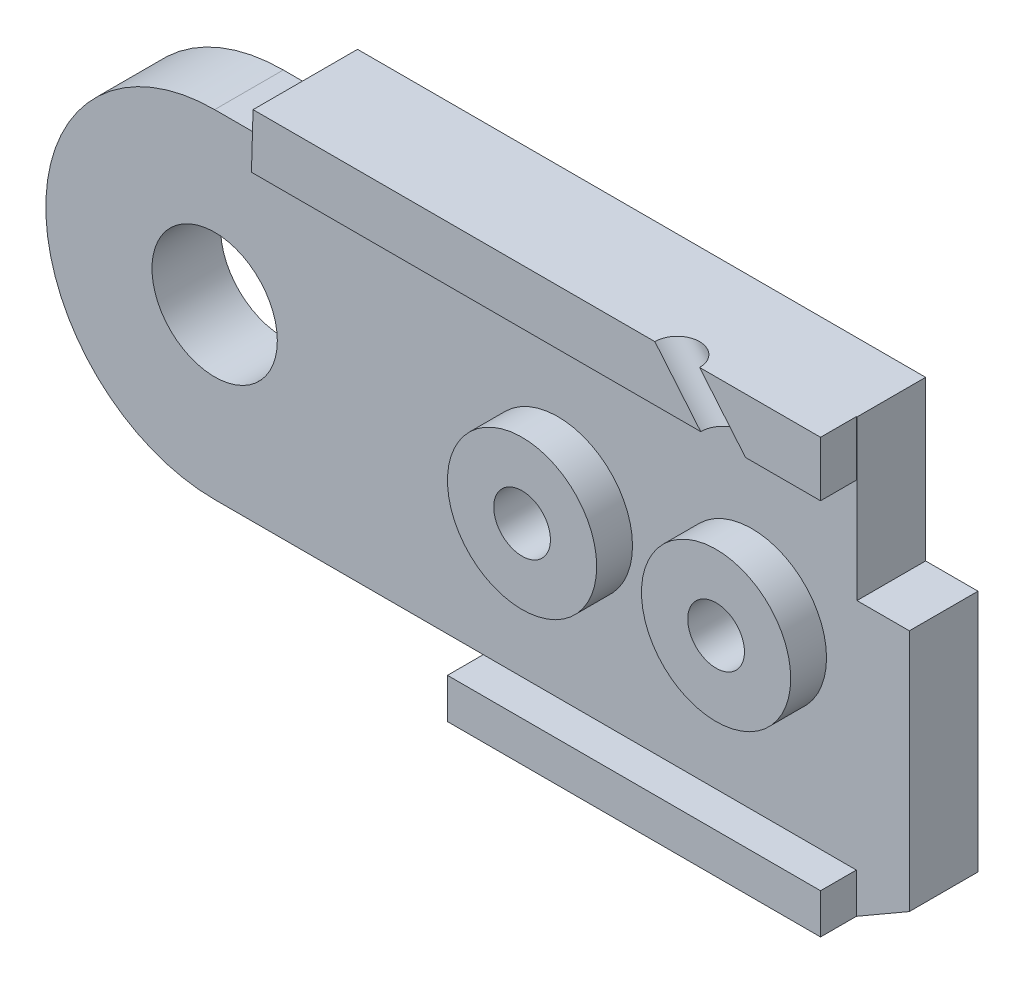
ISO-10303-21;
HEADER;
FILE_DESCRIPTION(('STEP AP214'),'2;1');
FILE_NAME('part.step','',(''),(''),'','','');
FILE_SCHEMA(('AUTOMOTIVE_DESIGN { 1 0 10303 214 1 1 1 1 }'));
ENDSEC;
DATA;
#1=APPLICATION_CONTEXT('core data for automotive mechanical design processes');
#2=APPLICATION_PROTOCOL_DEFINITION('international standard','automotive_design',2000,#1);
#3=PRODUCT_CONTEXT('',#1,'mechanical');
#4=PRODUCT('Part','Part','',(#3));
#5=PRODUCT_RELATED_PRODUCT_CATEGORY('part','',(#4));
#6=PRODUCT_DEFINITION_FORMATION('','',#4);
#7=PRODUCT_DEFINITION_CONTEXT('part definition',#1,'design');
#8=PRODUCT_DEFINITION('design','',#6,#7);
#9=PRODUCT_DEFINITION_SHAPE('','',#8);
#10=(LENGTH_UNIT() NAMED_UNIT(*) SI_UNIT(.MILLI.,.METRE.));
#11=(NAMED_UNIT(*) PLANE_ANGLE_UNIT() SI_UNIT($,.RADIAN.));
#12=(NAMED_UNIT(*) SI_UNIT($,.STERADIAN.) SOLID_ANGLE_UNIT());
#13=UNCERTAINTY_MEASURE_WITH_UNIT(LENGTH_MEASURE(1.E-05),#10,'distance_accuracy_value','');
#14=(GEOMETRIC_REPRESENTATION_CONTEXT(3) GLOBAL_UNCERTAINTY_ASSIGNED_CONTEXT((#13)) GLOBAL_UNIT_ASSIGNED_CONTEXT((#10,
#11,#12)) REPRESENTATION_CONTEXT('',''));
#15=CARTESIAN_POINT('',(0.,0.,0.));
#16=DIRECTION('',(0.,0.,1.));
#17=DIRECTION('',(1.,0.,0.));
#18=AXIS2_PLACEMENT_3D('',#15,#16,#17);
#19=CARTESIAN_POINT('',(0.,0.,4.5));
#20=DIRECTION('',(0.,0.,1.));
#21=DIRECTION('',(1.,0.,0.));
#22=AXIS2_PLACEMENT_3D('',#19,#20,#21);
#23=PLANE('',#22);
#24=CARTESIAN_POINT('',(11.5,0.,4.5));
#25=DIRECTION('',(0.,0.,1.));
#26=DIRECTION('',(1.,0.,0.));
#27=AXIS2_PLACEMENT_3D('',#24,#25,#26);
#28=CIRCLE('',#27,0.949999999999999);
#29=CARTESIAN_POINT('',(12.45,0.,4.5));
#30=VERTEX_POINT('',#29);
#31=EDGE_CURVE('E707',#30,#30,#28,.T.);
#32=ORIENTED_EDGE('',*,*,#31,.T.);
#33=EDGE_LOOP('',(#32));
#34=FACE_BOUND('',#33,.T.);
#35=CARTESIAN_POINT('',(18.,0.,4.5));
#36=DIRECTION('',(0.,0.,1.));
#37=DIRECTION('',(1.,0.,0.));
#38=AXIS2_PLACEMENT_3D('',#35,#36,#37);
#39=CIRCLE('',#38,0.950000000000001);
#40=CARTESIAN_POINT('',(18.95,0.,4.5));
#41=VERTEX_POINT('',#40);
#42=EDGE_CURVE('E700',#41,#41,#39,.T.);
#43=ORIENTED_EDGE('',*,*,#42,.T.);
#44=EDGE_LOOP('',(#43));
#45=FACE_BOUND('',#44,.T.);
#46=CARTESIAN_POINT('',(0.,0.,4.5));
#47=DIRECTION('',(0.,0.,1.));
#48=DIRECTION('',(1.,0.,0.));
#49=AXIS2_PLACEMENT_3D('',#46,#47,#48);
#50=CIRCLE('',#49,2.1);
#51=CARTESIAN_POINT('',(2.1,0.,4.5));
#52=VERTEX_POINT('',#51);
#53=EDGE_CURVE('E217',#52,#52,#50,.T.);
#54=ORIENTED_EDGE('',*,*,#53,.T.);
#55=EDGE_LOOP('',(#54));
#56=FACE_BOUND('',#55,.T.);
#57=DIRECTION('',(0.,-1.,0.));
#58=VECTOR('',#57,1.);
#59=CARTESIAN_POINT('',(21.5203540034992,0.,4.5));
#60=LINE('',#59,#58);
#61=CARTESIAN_POINT('',(21.5203540034992,7.5,4.5));
#62=VERTEX_POINT('',#61);
#63=CARTESIAN_POINT('',(21.5203540034992,2.1720062451962,4.5));
#64=VERTEX_POINT('',#63);
#65=EDGE_CURVE('E309',#62,#64,#60,.T.);
#66=ORIENTED_EDGE('',*,*,#65,.T.);
#67=DIRECTION('',(1.,0.,0.));
#68=VECTOR('',#67,1.);
#69=CARTESIAN_POINT('',(0.,2.1720062451962,4.5));
#70=LINE('',#69,#68);
#71=CARTESIAN_POINT('',(23.2751262658471,2.1720062451962,4.5));
#72=VERTEX_POINT('',#71);
#73=EDGE_CURVE('E313',#64,#72,#70,.T.);
#74=ORIENTED_EDGE('',*,*,#73,.T.);
#75=DIRECTION('',(0.,1.,0.));
#76=VECTOR('',#75,1.);
#77=CARTESIAN_POINT('',(23.2751262658471,-5.97487373415292,4.5));
#78=LINE('',#77,#76);
#79=CARTESIAN_POINT('',(23.2751262658471,-5.97487373415292,4.5));
#80=VERTEX_POINT('',#79);
#81=EDGE_CURVE('E263',#80,#72,#78,.T.);
#82=ORIENTED_EDGE('',*,*,#81,.F.);
#83=DIRECTION('',(0.865971186561437,0.500093895229063,0.));
#84=VECTOR('',#83,1.);
#85=CARTESIAN_POINT('',(21.5,-6.99999999999999,4.5));
#86=LINE('',#85,#84);
#87=CARTESIAN_POINT('',(21.5,-6.99999999999999,4.5));
#88=VERTEX_POINT('',#87);
#89=EDGE_CURVE('E260',#88,#80,#86,.T.);
#90=ORIENTED_EDGE('',*,*,#89,.F.);
#91=DIRECTION('',(1.,0.,0.));
#92=VECTOR('',#91,1.);
#93=CARTESIAN_POINT('',(9.,-6.99999999999999,4.5));
#94=LINE('',#93,#92);
#95=CARTESIAN_POINT('',(9.,-6.99999999999999,4.5));
#96=VERTEX_POINT('',#95);
#97=EDGE_CURVE('E257',#96,#88,#94,.T.);
#98=ORIENTED_EDGE('',*,*,#97,.F.);
#99=DIRECTION('',(0.,-1.,0.));
#100=VECTOR('',#99,1.);
#101=CARTESIAN_POINT('',(9.,-6.99999999999999,4.5));
#102=LINE('',#101,#100);
#103=CARTESIAN_POINT('',(9.,-5.65685424949238,4.5));
#104=VERTEX_POINT('',#103);
#105=EDGE_CURVE('E254',#104,#96,#102,.T.);
#106=ORIENTED_EDGE('',*,*,#105,.F.);
#107=DIRECTION('',(1.,0.,0.));
#108=VECTOR('',#107,1.);
#109=CARTESIAN_POINT('',(9.,-5.65685424949238,4.5));
#110=LINE('',#109,#108);
#111=CARTESIAN_POINT('',(0.,-5.65685424949238,4.5));
#112=VERTEX_POINT('',#111);
#113=EDGE_CURVE('E251',#112,#104,#110,.T.);
#114=ORIENTED_EDGE('',*,*,#113,.F.);
#115=CARTESIAN_POINT('',(0.,0.,4.5));
#116=DIRECTION('',(0.,0.,1.));
#117=DIRECTION('',(1.,0.,0.));
#118=AXIS2_PLACEMENT_3D('',#115,#116,#117);
#119=CIRCLE('',#118,5.65685424949238);
#120=CARTESIAN_POINT('',(0.,5.65685424949238,4.5));
#121=VERTEX_POINT('',#120);
#122=EDGE_CURVE('E221',#121,#112,#119,.T.);
#123=ORIENTED_EDGE('',*,*,#122,.F.);
#124=DIRECTION('',(-1.,0.,0.));
#125=VECTOR('',#124,1.);
#126=CARTESIAN_POINT('',(2.4326880657739,5.65685424949238,4.5));
#127=LINE('',#126,#125);
#128=CARTESIAN_POINT('',(2.4326880657739,5.65685424949238,4.5));
#129=VERTEX_POINT('',#128);
#130=EDGE_CURVE('E230',#129,#121,#127,.T.);
#131=ORIENTED_EDGE('',*,*,#130,.F.);
#132=DIRECTION('',(-0.0293404845923219,-0.999569475306188,0.));
#133=VECTOR('',#132,1.);
#134=CARTESIAN_POINT('',(2.4326880657739,5.65685424949238,4.5));
#135=LINE('',#134,#133);
#136=CARTESIAN_POINT('',(2.48679014755027,7.5,4.5));
#137=VERTEX_POINT('',#136);
#138=EDGE_CURVE('E270',#137,#129,#135,.T.);
#139=ORIENTED_EDGE('',*,*,#138,.F.);
#140=DIRECTION('',(-1.,0.,0.));
#141=VECTOR('',#140,1.);
#142=CARTESIAN_POINT('',(27.,7.5,4.5));
#143=LINE('',#142,#141);
#144=EDGE_CURVE('E267',#62,#137,#143,.T.);
#145=ORIENTED_EDGE('',*,*,#144,.F.);
#146=EDGE_LOOP('',(#66,#74,#82,#90,#98,#106,#114,#123,#131,#139,#145));
#147=FACE_BOUND('',#146,.T.);
#148=ADVANCED_FACE('F42',(#34,#45,#56,#147),#23,.F.);
#149=CARTESIAN_POINT('',(11.5,0.,8.));
#150=DIRECTION('',(0.,0.,-1.));
#151=DIRECTION('',(-1.,0.,0.));
#152=AXIS2_PLACEMENT_3D('',#149,#150,#151);
#153=CYLINDRICAL_SURFACE('',#152,2.5);
#154=CARTESIAN_POINT('',(11.5,0.,8.));
#155=DIRECTION('',(0.,0.,1.));
#156=DIRECTION('',(1.,0.,0.));
#157=AXIS2_PLACEMENT_3D('',#154,#155,#156);
#158=CIRCLE('',#157,2.5);
#159=CARTESIAN_POINT('',(14.,0.,8.));
#160=VERTEX_POINT('',#159);
#161=EDGE_CURVE('E346',#160,#160,#158,.T.);
#162=ORIENTED_EDGE('',*,*,#161,.F.);
#163=EDGE_LOOP('',(#162));
#164=FACE_BOUND('',#163,.T.);
#165=CARTESIAN_POINT('',(11.5,0.,6.8));
#166=DIRECTION('',(0.,0.,1.));
#167=DIRECTION('',(1.,0.,0.));
#168=AXIS2_PLACEMENT_3D('',#165,#166,#167);
#169=CIRCLE('',#168,2.5);
#170=CARTESIAN_POINT('',(14.,0.,6.8));
#171=VERTEX_POINT('',#170);
#172=EDGE_CURVE('E716',#171,#171,#169,.T.);
#173=ORIENTED_EDGE('',*,*,#172,.T.);
#174=EDGE_LOOP('',(#173));
#175=FACE_BOUND('',#174,.T.);
#176=ADVANCED_FACE('F437',(#164,#175),#153,.T.);
#177=CARTESIAN_POINT('',(18.,0.,8.));
#178=DIRECTION('',(0.,0.,-1.));
#179=DIRECTION('',(-1.,0.,0.));
#180=AXIS2_PLACEMENT_3D('',#177,#178,#179);
#181=CYLINDRICAL_SURFACE('',#180,2.5);
#182=CARTESIAN_POINT('',(18.,0.,8.));
#183=DIRECTION('',(0.,0.,1.));
#184=DIRECTION('',(1.,0.,0.));
#185=AXIS2_PLACEMENT_3D('',#182,#183,#184);
#186=CIRCLE('',#185,2.5);
#187=CARTESIAN_POINT('',(20.5,0.,8.));
#188=VERTEX_POINT('',#187);
#189=EDGE_CURVE('E712',#188,#188,#186,.T.);
#190=ORIENTED_EDGE('',*,*,#189,.F.);
#191=EDGE_LOOP('',(#190));
#192=FACE_BOUND('',#191,.T.);
#193=CARTESIAN_POINT('',(18.,0.,6.8));
#194=DIRECTION('',(0.,0.,1.));
#195=DIRECTION('',(1.,0.,0.));
#196=AXIS2_PLACEMENT_3D('',#193,#194,#195);
#197=CIRCLE('',#196,2.5);
#198=CARTESIAN_POINT('',(20.5,0.,6.8));
#199=VERTEX_POINT('',#198);
#200=EDGE_CURVE('E711',#199,#199,#197,.T.);
#201=ORIENTED_EDGE('',*,*,#200,.T.);
#202=EDGE_LOOP('',(#201));
#203=FACE_BOUND('',#202,.T.);
#204=ADVANCED_FACE('F439',(#192,#203),#181,.T.);
#205=CARTESIAN_POINT('',(27.,2.1720062451962,4.4));
#206=DIRECTION('',(0.,-1.,0.));
#207=DIRECTION('',(0.,0.,-1.));
#208=AXIS2_PLACEMENT_3D('',#205,#206,#207);
#209=PLANE('',#208);
#210=ORIENTED_EDGE('',*,*,#73,.F.);
#211=DIRECTION('',(0.,0.,1.));
#212=VECTOR('',#211,1.);
#213=CARTESIAN_POINT('',(21.5203540034992,2.1720062451962,4.4));
#214=LINE('',#213,#212);
#215=CARTESIAN_POINT('',(21.5203540034992,2.1720062451962,6.8));
#216=VERTEX_POINT('',#215);
#217=EDGE_CURVE('E65',#64,#216,#214,.T.);
#218=ORIENTED_EDGE('',*,*,#217,.T.);
#219=DIRECTION('',(1.,0.,0.));
#220=VECTOR('',#219,1.);
#221=CARTESIAN_POINT('',(27.,2.1720062451962,6.8));
#222=LINE('',#221,#220);
#223=CARTESIAN_POINT('',(23.2751262658471,2.1720062451962,6.8));
#224=VERTEX_POINT('',#223);
#225=EDGE_CURVE('E340',#216,#224,#222,.T.);
#226=ORIENTED_EDGE('',*,*,#225,.T.);
#227=DIRECTION('',(0.,0.,-1.));
#228=VECTOR('',#227,1.);
#229=CARTESIAN_POINT('',(23.2751262658471,2.1720062451962,6.8));
#230=LINE('',#229,#228);
#231=EDGE_CURVE('E286',#224,#72,#230,.T.);
#232=ORIENTED_EDGE('',*,*,#231,.T.);
#233=EDGE_LOOP('',(#210,#218,#226,#232));
#234=FACE_BOUND('',#233,.T.);
#235=ADVANCED_FACE('F420',(#234),#209,.F.);
#236=CARTESIAN_POINT('',(23.2751262658471,-5.97487373415292,6.8));
#237=DIRECTION('',(-1.,0.,0.));
#238=DIRECTION('',(0.,0.,1.));
#239=AXIS2_PLACEMENT_3D('',#236,#237,#238);
#240=PLANE('',#239);
#241=ORIENTED_EDGE('',*,*,#81,.T.);
#242=ORIENTED_EDGE('',*,*,#231,.F.);
#243=DIRECTION('',(0.,1.,0.));
#244=VECTOR('',#243,1.);
#245=CARTESIAN_POINT('',(23.2751262658471,-5.97487373415292,6.8));
#246=LINE('',#245,#244);
#247=CARTESIAN_POINT('',(23.2751262658471,-5.97487373415292,6.8));
#248=VERTEX_POINT('',#247);
#249=EDGE_CURVE('E237',#248,#224,#246,.T.);
#250=ORIENTED_EDGE('',*,*,#249,.F.);
#251=DIRECTION('',(0.,0.,-1.));
#252=VECTOR('',#251,1.);
#253=CARTESIAN_POINT('',(23.2751262658471,-5.97487373415292,6.8));
#254=LINE('',#253,#252);
#255=EDGE_CURVE('E289',#248,#80,#254,.T.);
#256=ORIENTED_EDGE('',*,*,#255,.T.);
#257=EDGE_LOOP('',(#241,#242,#250,#256));
#258=FACE_BOUND('',#257,.T.);
#259=ADVANCED_FACE('F418',(#258),#240,.F.);
#260=CARTESIAN_POINT('',(21.5,-6.99999999999999,8.));
#261=DIRECTION('',(-1.,0.,0.));
#262=DIRECTION('',(0.,0.,1.));
#263=AXIS2_PLACEMENT_3D('',#260,#261,#262);
#264=PLANE('',#263);
#265=DIRECTION('',(0.,1.,0.));
#266=VECTOR('',#265,1.);
#267=CARTESIAN_POINT('',(21.5,-6.99999999999999,6.8));
#268=LINE('',#267,#266);
#269=CARTESIAN_POINT('',(21.5,-6.99999999999999,6.8));
#270=VERTEX_POINT('',#269);
#271=CARTESIAN_POINT('',(21.5,-5.65685424949238,6.8));
#272=VERTEX_POINT('',#271);
#273=EDGE_CURVE('E358',#270,#272,#268,.T.);
#274=ORIENTED_EDGE('',*,*,#273,.T.);
#275=DIRECTION('',(0.,0.,-1.));
#276=VECTOR('',#275,1.);
#277=CARTESIAN_POINT('',(21.5,-5.65685424949238,8.));
#278=LINE('',#277,#276);
#279=CARTESIAN_POINT('',(21.5,-5.65685424949238,8.));
#280=VERTEX_POINT('',#279);
#281=EDGE_CURVE('E368',#280,#272,#278,.T.);
#282=ORIENTED_EDGE('',*,*,#281,.F.);
#283=DIRECTION('',(0.,1.,0.));
#284=VECTOR('',#283,1.);
#285=CARTESIAN_POINT('',(21.5,-6.99999999999999,8.));
#286=LINE('',#285,#284);
#287=CARTESIAN_POINT('',(21.5,-6.99999999999999,8.));
#288=VERTEX_POINT('',#287);
#289=EDGE_CURVE('E365',#288,#280,#286,.T.);
#290=ORIENTED_EDGE('',*,*,#289,.F.);
#291=DIRECTION('',(0.,0.,-1.));
#292=VECTOR('',#291,1.);
#293=CARTESIAN_POINT('',(21.5,-6.99999999999999,8.));
#294=LINE('',#293,#292);
#295=EDGE_CURVE('E377',#288,#270,#294,.T.);
#296=ORIENTED_EDGE('',*,*,#295,.T.);
#297=EDGE_LOOP('',(#274,#282,#290,#296));
#298=FACE_BOUND('',#297,.T.);
#299=ADVANCED_FACE('F409',(#298),#264,.F.);
#300=CARTESIAN_POINT('',(21.5,-6.99999999999999,6.8));
#301=DIRECTION('',(-0.500093895229063,0.865971186561437,0.));
#302=DIRECTION('',(-0.865971186561437,-0.500093895229063,0.));
#303=AXIS2_PLACEMENT_3D('',#300,#301,#302);
#304=PLANE('',#303);
#305=ORIENTED_EDGE('',*,*,#89,.T.);
#306=ORIENTED_EDGE('',*,*,#255,.F.);
#307=DIRECTION('',(0.865971186561437,0.500093895229063,0.));
#308=VECTOR('',#307,1.);
#309=CARTESIAN_POINT('',(21.5,-6.99999999999999,6.8));
#310=LINE('',#309,#308);
#311=EDGE_CURVE('E234',#270,#248,#310,.T.);
#312=ORIENTED_EDGE('',*,*,#311,.F.);
#313=DIRECTION('',(0.,0.,-1.));
#314=VECTOR('',#313,1.);
#315=CARTESIAN_POINT('',(21.5,-6.99999999999999,6.8));
#316=LINE('',#315,#314);
#317=EDGE_CURVE('E293',#270,#88,#316,.T.);
#318=ORIENTED_EDGE('',*,*,#317,.T.);
#319=EDGE_LOOP('',(#305,#306,#312,#318));
#320=FACE_BOUND('',#319,.T.);
#321=ADVANCED_FACE('F413',(#320),#304,.F.);
#322=CARTESIAN_POINT('',(21.5,-5.65685424949238,8.));
#323=DIRECTION('',(0.,-1.,0.));
#324=DIRECTION('',(0.,0.,-1.));
#325=AXIS2_PLACEMENT_3D('',#322,#323,#324);
#326=PLANE('',#325);
#327=DIRECTION('',(-1.,0.,0.));
#328=VECTOR('',#327,1.);
#329=CARTESIAN_POINT('',(21.5,-5.65685424949238,6.8));
#330=LINE('',#329,#328);
#331=CARTESIAN_POINT('',(9.,-5.65685424949238,6.8));
#332=VERTEX_POINT('',#331);
#333=EDGE_CURVE('E351',#272,#332,#330,.T.);
#334=ORIENTED_EDGE('',*,*,#333,.T.);
#335=DIRECTION('',(0.,0.,-1.));
#336=VECTOR('',#335,1.);
#337=CARTESIAN_POINT('',(9.,-5.65685424949238,8.));
#338=LINE('',#337,#336);
#339=CARTESIAN_POINT('',(9.,-5.65685424949238,8.));
#340=VERTEX_POINT('',#339);
#341=EDGE_CURVE('E202',#340,#332,#338,.T.);
#342=ORIENTED_EDGE('',*,*,#341,.F.);
#343=DIRECTION('',(-1.,0.,0.));
#344=VECTOR('',#343,1.);
#345=CARTESIAN_POINT('',(21.5,-5.65685424949238,8.));
#346=LINE('',#345,#344);
#347=EDGE_CURVE('E353',#280,#340,#346,.T.);
#348=ORIENTED_EDGE('',*,*,#347,.F.);
#349=ORIENTED_EDGE('',*,*,#281,.T.);
#350=EDGE_LOOP('',(#334,#342,#348,#349));
#351=FACE_BOUND('',#350,.T.);
#352=ADVANCED_FACE('F388',(#351),#326,.F.);
#353=CARTESIAN_POINT('',(0.,0.,8.));
#354=DIRECTION('',(0.,0.,1.));
#355=DIRECTION('',(1.,0.,0.));
#356=AXIS2_PLACEMENT_3D('',#353,#354,#355);
#357=PLANE('',#356);
#358=ORIENTED_EDGE('',*,*,#347,.T.);
#359=DIRECTION('',(0.,-1.,0.));
#360=VECTOR('',#359,1.);
#361=CARTESIAN_POINT('',(9.,-5.65685424949238,8.));
#362=LINE('',#361,#360);
#363=CARTESIAN_POINT('',(9.,-6.99999999999999,8.));
#364=VERTEX_POINT('',#363);
#365=EDGE_CURVE('E357',#340,#364,#362,.T.);
#366=ORIENTED_EDGE('',*,*,#365,.T.);
#367=DIRECTION('',(1.,0.,0.));
#368=VECTOR('',#367,1.);
#369=CARTESIAN_POINT('',(9.,-6.99999999999999,8.));
#370=LINE('',#369,#368);
#371=EDGE_CURVE('E362',#364,#288,#370,.T.);
#372=ORIENTED_EDGE('',*,*,#371,.T.);
#373=ORIENTED_EDGE('',*,*,#289,.T.);
#374=EDGE_LOOP('',(#358,#366,#372,#373));
#375=FACE_BOUND('',#374,.T.);
#376=ADVANCED_FACE('F407',(#375),#357,.T.);
#377=CARTESIAN_POINT('',(9.,-6.99999999999999,6.8));
#378=DIRECTION('',(0.,1.,0.));
#379=DIRECTION('',(-1.,0.,0.));
#380=AXIS2_PLACEMENT_3D('',#377,#378,#379);
#381=PLANE('',#380);
#382=ORIENTED_EDGE('',*,*,#97,.T.);
#383=ORIENTED_EDGE('',*,*,#317,.F.);
#384=ORIENTED_EDGE('',*,*,#295,.F.);
#385=ORIENTED_EDGE('',*,*,#371,.F.);
#386=DIRECTION('',(0.,0.,-1.));
#387=VECTOR('',#386,1.);
#388=CARTESIAN_POINT('',(9.,-6.99999999999999,6.8));
#389=LINE('',#388,#387);
#390=EDGE_CURVE('E297',#364,#96,#389,.T.);
#391=ORIENTED_EDGE('',*,*,#390,.T.);
#392=EDGE_LOOP('',(#382,#383,#384,#385,#391));
#393=FACE_BOUND('',#392,.T.);
#394=ADVANCED_FACE('F402',(#393),#381,.F.);
#395=CARTESIAN_POINT('',(9.,-6.99999999999999,6.8));
#396=DIRECTION('',(1.,0.,0.));
#397=DIRECTION('',(0.,0.,-1.));
#398=AXIS2_PLACEMENT_3D('',#395,#396,#397);
#399=PLANE('',#398);
#400=ORIENTED_EDGE('',*,*,#105,.T.);
#401=ORIENTED_EDGE('',*,*,#390,.F.);
#402=ORIENTED_EDGE('',*,*,#365,.F.);
#403=ORIENTED_EDGE('',*,*,#341,.T.);
#404=DIRECTION('',(0.,0.,-1.));
#405=VECTOR('',#404,1.);
#406=CARTESIAN_POINT('',(9.,-5.65685424949238,6.8));
#407=LINE('',#406,#405);
#408=EDGE_CURVE('E301',#332,#104,#407,.T.);
#409=ORIENTED_EDGE('',*,*,#408,.T.);
#410=EDGE_LOOP('',(#400,#401,#402,#403,#409));
#411=FACE_BOUND('',#410,.T.);
#412=ADVANCED_FACE('F382',(#411),#399,.F.);
#413=CARTESIAN_POINT('',(9.,-5.65685424949238,6.8));
#414=DIRECTION('',(0.,1.,0.));
#415=DIRECTION('',(0.,0.,1.));
#416=AXIS2_PLACEMENT_3D('',#413,#414,#415);
#417=PLANE('',#416);
#418=ORIENTED_EDGE('',*,*,#113,.T.);
#419=ORIENTED_EDGE('',*,*,#408,.F.);
#420=DIRECTION('',(1.,0.,0.));
#421=VECTOR('',#420,1.);
#422=CARTESIAN_POINT('',(9.,-5.65685424949238,6.8));
#423=LINE('',#422,#421);
#424=CARTESIAN_POINT('',(0.,-5.65685424949238,6.8));
#425=VERTEX_POINT('',#424);
#426=EDGE_CURVE('E229',#425,#332,#423,.T.);
#427=ORIENTED_EDGE('',*,*,#426,.F.);
#428=DIRECTION('',(0.,0.,-1.));
#429=VECTOR('',#428,1.);
#430=CARTESIAN_POINT('',(0.,-5.65685424949238,6.8));
#431=LINE('',#430,#429);
#432=EDGE_CURVE('E305',#425,#112,#431,.T.);
#433=ORIENTED_EDGE('',*,*,#432,.T.);
#434=EDGE_LOOP('',(#418,#419,#427,#433));
#435=FACE_BOUND('',#434,.T.);
#436=ADVANCED_FACE('F394',(#435),#417,.F.);
#437=CARTESIAN_POINT('',(0.,0.,6.8));
#438=DIRECTION('',(0.,0.,-1.));
#439=DIRECTION('',(-1.,0.,0.));
#440=AXIS2_PLACEMENT_3D('',#437,#438,#439);
#441=CYLINDRICAL_SURFACE('',#440,5.65685424949238);
#442=ORIENTED_EDGE('',*,*,#122,.T.);
#443=ORIENTED_EDGE('',*,*,#432,.F.);
#444=CARTESIAN_POINT('',(0.,0.,6.8));
#445=DIRECTION('',(0.,0.,1.));
#446=DIRECTION('',(1.,0.,0.));
#447=AXIS2_PLACEMENT_3D('',#444,#445,#446);
#448=CIRCLE('',#447,5.65685424949238);
#449=CARTESIAN_POINT('',(0.,5.65685424949238,6.8));
#450=VERTEX_POINT('',#449);
#451=EDGE_CURVE('E225',#450,#425,#448,.T.);
#452=ORIENTED_EDGE('',*,*,#451,.F.);
#453=DIRECTION('',(0.,0.,-1.));
#454=VECTOR('',#453,1.);
#455=CARTESIAN_POINT('',(0.,5.65685424949238,6.8));
#456=LINE('',#455,#454);
#457=EDGE_CURVE('E247',#450,#121,#456,.T.);
#458=ORIENTED_EDGE('',*,*,#457,.T.);
#459=EDGE_LOOP('',(#442,#443,#452,#458));
#460=FACE_BOUND('',#459,.T.);
#461=ADVANCED_FACE('F44',(#460),#441,.T.);
#462=CARTESIAN_POINT('',(2.4326880657739,5.65685424949238,8.));
#463=DIRECTION('',(0.,1.,0.));
#464=DIRECTION('',(0.,0.,1.));
#465=AXIS2_PLACEMENT_3D('',#462,#463,#464);
#466=PLANE('',#465);
#467=DIRECTION('',(1.,0.,0.));
#468=VECTOR('',#467,1.);
#469=CARTESIAN_POINT('',(2.4326880657739,5.65685424949238,8.));
#470=LINE('',#469,#468);
#471=CARTESIAN_POINT('',(18.9854768194204,5.65685424949238,8.));
#472=VERTEX_POINT('',#471);
#473=CARTESIAN_POINT('',(21.5,5.65685424949238,8.));
#474=VERTEX_POINT('',#473);
#475=EDGE_CURVE('E175',#472,#474,#470,.T.);
#476=ORIENTED_EDGE('',*,*,#475,.F.);
#477=CARTESIAN_POINT('',(18.2354768194204,5.65685424949238,8.));
#478=DIRECTION('',(0.,-1.,0.));
#479=DIRECTION('',(0.,0.,-1.));
#480=AXIS2_PLACEMENT_3D('',#477,#478,#479);
#481=CIRCLE('',#480,0.750000000000002);
#482=CARTESIAN_POINT('',(17.4854768194204,5.65685424949238,8.));
#483=VERTEX_POINT('',#482);
#484=EDGE_CURVE('E57',#483,#472,#481,.T.);
#485=ORIENTED_EDGE('',*,*,#484,.F.);
#486=CARTESIAN_POINT('',(2.4326880657739,5.65685424949238,8.));
#487=VERTEX_POINT('',#486);
#488=EDGE_CURVE('E172',#487,#483,#470,.T.);
#489=ORIENTED_EDGE('',*,*,#488,.F.);
#490=DIRECTION('',(0.,0.,-1.));
#491=VECTOR('',#490,1.);
#492=CARTESIAN_POINT('',(2.4326880657739,5.65685424949238,8.));
#493=LINE('',#492,#491);
#494=CARTESIAN_POINT('',(2.4326880657739,5.65685424949238,6.8));
#495=VERTEX_POINT('',#494);
#496=EDGE_CURVE('E213',#487,#495,#493,.T.);
#497=ORIENTED_EDGE('',*,*,#496,.T.);
#498=DIRECTION('',(1.,0.,0.));
#499=VECTOR('',#498,1.);
#500=CARTESIAN_POINT('',(2.4326880657739,5.65685424949238,6.8));
#501=LINE('',#500,#499);
#502=CARTESIAN_POINT('',(21.5,5.65685424949238,6.8));
#503=VERTEX_POINT('',#502);
#504=EDGE_CURVE('E197',#495,#503,#501,.T.);
#505=ORIENTED_EDGE('',*,*,#504,.T.);
#506=DIRECTION('',(0.,0.,-1.));
#507=VECTOR('',#506,1.);
#508=CARTESIAN_POINT('',(21.5,5.65685424949238,8.));
#509=LINE('',#508,#507);
#510=EDGE_CURVE('E209',#474,#503,#509,.T.);
#511=ORIENTED_EDGE('',*,*,#510,.F.);
#512=EDGE_LOOP('',(#476,#485,#489,#497,#505,#511));
#513=FACE_BOUND('',#512,.T.);
#514=ADVANCED_FACE('F170',(#513),#466,.F.);
#515=CARTESIAN_POINT('',(2.4326880657739,5.65685424949238,6.8));
#516=DIRECTION('',(0.,-1.,0.));
#517=DIRECTION('',(0.,0.,-1.));
#518=AXIS2_PLACEMENT_3D('',#515,#516,#517);
#519=PLANE('',#518);
#520=ORIENTED_EDGE('',*,*,#130,.T.);
#521=ORIENTED_EDGE('',*,*,#457,.F.);
#522=DIRECTION('',(-1.,0.,0.));
#523=VECTOR('',#522,1.);
#524=CARTESIAN_POINT('',(2.4326880657739,5.65685424949238,6.8));
#525=LINE('',#524,#523);
#526=EDGE_CURVE('E244',#495,#450,#525,.T.);
#527=ORIENTED_EDGE('',*,*,#526,.F.);
#528=DIRECTION('',(0.,0.,-1.));
#529=VECTOR('',#528,1.);
#530=CARTESIAN_POINT('',(2.4326880657739,5.65685424949238,6.8));
#531=LINE('',#530,#529);
#532=EDGE_CURVE('E278',#495,#129,#531,.T.);
#533=ORIENTED_EDGE('',*,*,#532,.T.);
#534=EDGE_LOOP('',(#520,#521,#527,#533));
#535=FACE_BOUND('',#534,.T.);
#536=ADVANCED_FACE('F432',(#535),#519,.F.);
#537=CARTESIAN_POINT('',(2.4326880657739,5.65685424949238,6.8));
#538=DIRECTION('',(0.999569475306188,-0.0293404845923219,0.));
#539=DIRECTION('',(0.0293404845923219,0.999569475306188,0.));
#540=AXIS2_PLACEMENT_3D('',#537,#538,#539);
#541=PLANE('',#540);
#542=ORIENTED_EDGE('',*,*,#138,.T.);
#543=ORIENTED_EDGE('',*,*,#532,.F.);
#544=ORIENTED_EDGE('',*,*,#496,.F.);
#545=DIRECTION('',(-0.0293404845923219,-0.999569475306188,0.));
#546=VECTOR('',#545,1.);
#547=CARTESIAN_POINT('',(2.48679014755027,7.5,8.));
#548=LINE('',#547,#546);
#549=CARTESIAN_POINT('',(2.48679014755027,7.5,8.));
#550=VERTEX_POINT('',#549);
#551=EDGE_CURVE('E180',#550,#487,#548,.T.);
#552=ORIENTED_EDGE('',*,*,#551,.F.);
#553=DIRECTION('',(0.,0.,-1.));
#554=VECTOR('',#553,1.);
#555=CARTESIAN_POINT('',(2.48679014755027,7.5,6.8));
#556=LINE('',#555,#554);
#557=EDGE_CURVE('E282',#550,#137,#556,.T.);
#558=ORIENTED_EDGE('',*,*,#557,.T.);
#559=EDGE_LOOP('',(#542,#543,#544,#552,#558));
#560=FACE_BOUND('',#559,.T.);
#561=ADVANCED_FACE('F424',(#560),#541,.F.);
#562=CARTESIAN_POINT('',(21.5203540034992,2.1720062451962,4.4));
#563=DIRECTION('',(-1.,0.,0.));
#564=DIRECTION('',(0.,0.,1.));
#565=AXIS2_PLACEMENT_3D('',#562,#563,#564);
#566=PLANE('',#565);
#567=DIRECTION('',(0.,0.,1.));
#568=VECTOR('',#567,1.);
#569=CARTESIAN_POINT('',(21.5203540034992,7.5,4.4));
#570=LINE('',#569,#568);
#571=CARTESIAN_POINT('',(21.5203540034992,7.5,6.8));
#572=VERTEX_POINT('',#571);
#573=EDGE_CURVE('E332',#62,#572,#570,.T.);
#574=ORIENTED_EDGE('',*,*,#573,.T.);
#575=DIRECTION('',(0.,-1.,0.));
#576=VECTOR('',#575,1.);
#577=CARTESIAN_POINT('',(21.5203540034992,2.1720062451962,6.8));
#578=LINE('',#577,#576);
#579=EDGE_CURVE('E339',#572,#216,#578,.T.);
#580=ORIENTED_EDGE('',*,*,#579,.T.);
#581=ORIENTED_EDGE('',*,*,#217,.F.);
#582=ORIENTED_EDGE('',*,*,#65,.F.);
#583=EDGE_LOOP('',(#574,#580,#581,#582));
#584=FACE_BOUND('',#583,.T.);
#585=ADVANCED_FACE('F422',(#584),#566,.F.);
#586=CARTESIAN_POINT('',(0.,0.,6.8));
#587=DIRECTION('',(0.,0.,1.));
#588=DIRECTION('',(1.,0.,0.));
#589=AXIS2_PLACEMENT_3D('',#586,#587,#588);
#590=PLANE('',#589);
#591=ORIENTED_EDGE('',*,*,#200,.F.);
#592=EDGE_LOOP('',(#591));
#593=FACE_BOUND('',#592,.T.);
#594=ORIENTED_EDGE('',*,*,#172,.F.);
#595=EDGE_LOOP('',(#594));
#596=FACE_BOUND('',#595,.T.);
#597=ORIENTED_EDGE('',*,*,#225,.F.);
#598=ORIENTED_EDGE('',*,*,#579,.F.);
#599=DIRECTION('',(-1.,0.,0.));
#600=VECTOR('',#599,1.);
#601=CARTESIAN_POINT('',(27.,7.5,6.8));
#602=LINE('',#601,#600);
#603=CARTESIAN_POINT('',(21.5,7.5,6.8));
#604=VERTEX_POINT('',#603);
#605=EDGE_CURVE('E241',#572,#604,#602,.T.);
#606=ORIENTED_EDGE('',*,*,#605,.T.);
#607=DIRECTION('',(0.,1.,0.));
#608=VECTOR('',#607,1.);
#609=CARTESIAN_POINT('',(21.5,5.65685424949238,6.8));
#610=LINE('',#609,#608);
#611=EDGE_CURVE('E201',#503,#604,#610,.T.);
#612=ORIENTED_EDGE('',*,*,#611,.F.);
#613=ORIENTED_EDGE('',*,*,#504,.F.);
#614=ORIENTED_EDGE('',*,*,#526,.T.);
#615=ORIENTED_EDGE('',*,*,#451,.T.);
#616=ORIENTED_EDGE('',*,*,#426,.T.);
#617=ORIENTED_EDGE('',*,*,#333,.F.);
#618=ORIENTED_EDGE('',*,*,#273,.F.);
#619=ORIENTED_EDGE('',*,*,#311,.T.);
#620=ORIENTED_EDGE('',*,*,#249,.T.);
#621=EDGE_LOOP('',(#597,#598,#606,#612,#613,#614,#615,#616,#617,#618,#619,#620));
#622=FACE_BOUND('',#621,.T.);
#623=CARTESIAN_POINT('',(0.,0.,6.8));
#624=DIRECTION('',(0.,0.,1.));
#625=DIRECTION('',(1.,0.,0.));
#626=AXIS2_PLACEMENT_3D('',#623,#624,#625);
#627=CIRCLE('',#626,2.1);
#628=CARTESIAN_POINT('',(2.1,0.,6.8));
#629=VERTEX_POINT('',#628);
#630=EDGE_CURVE('E216',#629,#629,#627,.T.);
#631=ORIENTED_EDGE('',*,*,#630,.F.);
#632=EDGE_LOOP('',(#631));
#633=FACE_BOUND('',#632,.T.);
#634=ADVANCED_FACE('F337',(#593,#596,#622,#633),#590,.T.);
#635=CARTESIAN_POINT('',(21.5,5.65685424949238,8.));
#636=DIRECTION('',(-1.,0.,0.));
#637=DIRECTION('',(0.,0.,1.));
#638=AXIS2_PLACEMENT_3D('',#635,#636,#637);
#639=PLANE('',#638);
#640=ORIENTED_EDGE('',*,*,#611,.T.);
#641=DIRECTION('',(0.,0.,-1.));
#642=VECTOR('',#641,1.);
#643=CARTESIAN_POINT('',(21.5,7.5,8.));
#644=LINE('',#643,#642);
#645=CARTESIAN_POINT('',(21.5,7.5,8.));
#646=VERTEX_POINT('',#645);
#647=EDGE_CURVE('E196',#646,#604,#644,.T.);
#648=ORIENTED_EDGE('',*,*,#647,.F.);
#649=DIRECTION('',(0.,1.,0.));
#650=VECTOR('',#649,1.);
#651=CARTESIAN_POINT('',(21.5,5.65685424949238,8.));
#652=LINE('',#651,#650);
#653=EDGE_CURVE('E183',#474,#646,#652,.T.);
#654=ORIENTED_EDGE('',*,*,#653,.F.);
#655=ORIENTED_EDGE('',*,*,#510,.T.);
#656=EDGE_LOOP('',(#640,#648,#654,#655));
#657=FACE_BOUND('',#656,.T.);
#658=ADVANCED_FACE('F329',(#657),#639,.F.);
#659=CARTESIAN_POINT('',(0.,0.,8.));
#660=DIRECTION('',(0.,0.,1.));
#661=DIRECTION('',(1.,0.,0.));
#662=AXIS2_PLACEMENT_3D('',#659,#660,#661);
#663=PLANE('',#662);
#664=DIRECTION('',(0.640410196211525,-0.768033059567306,0.));
#665=VECTOR('',#664,1.);
#666=CARTESIAN_POINT('',(12.5813748573051,13.3371848451654,8.));
#667=LINE('',#666,#665);
#668=CARTESIAN_POINT('',(17.4486037421156,7.5,8.));
#669=VERTEX_POINT('',#668);
#670=EDGE_CURVE('E51',#472,#669,#667,.F.);
#671=ORIENTED_EDGE('',*,*,#670,.F.);
#672=ORIENTED_EDGE('',*,*,#475,.T.);
#673=ORIENTED_EDGE('',*,*,#653,.T.);
#674=DIRECTION('',(-1.,0.,0.));
#675=VECTOR('',#674,1.);
#676=CARTESIAN_POINT('',(2.48679014755027,7.5,8.));
#677=LINE('',#676,#675);
#678=EDGE_CURVE('E192',#646,#669,#677,.T.);
#679=ORIENTED_EDGE('',*,*,#678,.T.);
#680=EDGE_LOOP('',(#671,#672,#673,#679));
#681=FACE_BOUND('',#680,.T.);
#682=ADVANCED_FACE('F325',(#681),#663,.T.);
#683=CARTESIAN_POINT('',(11.8313748573051,13.3371848451654,8.));
#684=DIRECTION('',(0.,-1.,0.));
#685=DIRECTION('',(0.,0.,-1.));
#686=AXIS2_PLACEMENT_3D('',#683,#684,#685);
#687=CIRCLE('',#686,0.750000000000002);
#688=DIRECTION('',(0.640410196211525,-0.768033059567306,0.));
#689=VECTOR('',#688,1.);
#690=SURFACE_OF_LINEAR_EXTRUSION('',#687,#689);
#691=DIRECTION('',(0.640410196211525,-0.768033059567306,0.));
#692=VECTOR('',#691,1.);
#693=CARTESIAN_POINT('',(11.0813748573051,13.3371848451654,8.));
#694=LINE('',#693,#692);
#695=CARTESIAN_POINT('',(15.9486037421156,7.5,8.));
#696=VERTEX_POINT('',#695);
#697=EDGE_CURVE('E12',#696,#483,#694,.T.);
#698=ORIENTED_EDGE('',*,*,#697,.T.);
#699=ORIENTED_EDGE('',*,*,#484,.T.);
#700=ORIENTED_EDGE('',*,*,#670,.T.);
#701=CARTESIAN_POINT('',(15.9486037421156,7.5,8.));
#702=CARTESIAN_POINT('',(15.9485828223259,7.5,7.96299421800191));
#703=CARTESIAN_POINT('',(15.9513415433594,7.5,7.92599480882229));
#704=CARTESIAN_POINT('',(15.9622658553059,7.5,7.85280214845709));
#705=CARTESIAN_POINT('',(15.9704314462188,7.5,7.81660889727152));
#706=CARTESIAN_POINT('',(15.9921393934185,7.5,7.74542087657391));
#707=CARTESIAN_POINT('',(16.0057416320877,7.5,7.71044433655034));
#708=CARTESIAN_POINT('',(16.038007282868,7.5,7.64291055089048));
#709=CARTESIAN_POINT('',(16.0566711070594,7.5,7.61035350250797));
#710=CARTESIAN_POINT('',(16.1009739517884,7.5,7.54495610451522));
#711=CARTESIAN_POINT('',(16.1271556218163,7.5,7.51248144744488));
#712=CARTESIAN_POINT('',(16.1845300787262,7.5,7.45231690208434));
#713=CARTESIAN_POINT('',(16.215722865608,7.5,7.42462701379413));
#714=CARTESIAN_POINT('',(16.2822616845173,7.5,7.37479057971385));
#715=CARTESIAN_POINT('',(16.3176077165447,7.5,7.3526440339238));
#716=CARTESIAN_POINT('',(16.3914774729578,7.5,7.3145064968947));
#717=CARTESIAN_POINT('',(16.4300011973436,7.5,7.29851550565565));
#718=CARTESIAN_POINT('',(16.509163978992,7.5,7.27312976103131));
#719=CARTESIAN_POINT('',(16.5498030362547,7.5,7.26373500764601));
#720=CARTESIAN_POINT('',(16.632075555852,7.5,7.25180095836177));
#721=CARTESIAN_POINT('',(16.6737090181867,7.5,7.24926166246284));
#722=CARTESIAN_POINT('',(16.7568220529829,7.5,7.2511085370352));
#723=CARTESIAN_POINT('',(16.7983016254444,7.5,7.25549470750648));
#724=CARTESIAN_POINT('',(16.8799628150021,7.5,7.27107155208883));
#725=CARTESIAN_POINT('',(16.9201444320982,7.5,7.28226222619989));
#726=CARTESIAN_POINT('',(16.9981014450578,7.5,7.31113939718431));
#727=CARTESIAN_POINT('',(17.0358768409213,7.5,7.32882589405766));
#728=CARTESIAN_POINT('',(17.1079795264237,7.5,7.37020698670185));
#729=CARTESIAN_POINT('',(17.1423068160626,7.5,7.3939015824727));
#730=CARTESIAN_POINT('',(17.2065664512203,7.5,7.44664499570797));
#731=CARTESIAN_POINT('',(17.2364987967392,7.5,7.4756938131724));
#732=CARTESIAN_POINT('',(17.2911431356884,7.5,7.5383457625048));
#733=CARTESIAN_POINT('',(17.3158551291189,7.5,7.57194889437277));
#734=CARTESIAN_POINT('',(17.3593765510825,7.5,7.64277780637736));
#735=CARTESIAN_POINT('',(17.3781859796156,7.5,7.68000358651398));
#736=CARTESIAN_POINT('',(17.4093858052971,7.5,7.75706914341449));
#737=CARTESIAN_POINT('',(17.4217762024454,7.5,7.79690892017838));
#738=CARTESIAN_POINT('',(17.4366988841339,7.5,7.86412407662256));
#739=CARTESIAN_POINT('',(17.4411547413667,7.5,7.89108809517031));
#740=CARTESIAN_POINT('',(17.4471101011285,7.5,7.945363879891));
#741=CARTESIAN_POINT('',(17.4486070790076,7.5,7.97267592303649));
#742=CARTESIAN_POINT('',(17.4486037421156,7.5,7.99999999999999));
#743=B_SPLINE_CURVE_WITH_KNOTS('',3,(#701,#702,#703,#704,#705,#706,#707,#708,#709,#710,#711,
#712,#713,#714,#715,#716,#717,#718,#719,#720,#721,#722,#723,#724,#725,#726,#727,#728,#729,#730,
#731,#732,#733,#734,#735,#736,#737,#738,#739,#740,#741,#742),.UNSPECIFIED.,.F.,.F.,(4,2,2,2,2,2,
2,2,2,2,2,2,2,2,2,2,2,2,2,2,4),(0.,0.110905075743071,0.221810151486143,0.333972034634098,
0.446143051990056,0.570700323775496,0.695257595560365,0.819814867345232,0.944372139130096,
1.06892941091496,1.19348668269983,1.31804395448469,1.44260122626956,1.56715849805442,
1.69171576983929,1.81627304162415,1.94083031340901,2.06538758519388,2.18994485697874,
2.27178284385731,2.35369062852365),.UNSPECIFIED.);
#744=EDGE_CURVE('E164',#696,#669,#743,.T.);
#745=ORIENTED_EDGE('',*,*,#744,.F.);
#746=EDGE_LOOP('',(#698,#699,#700,#745));
#747=FACE_BOUND('',#746,.T.);
#748=ADVANCED_FACE('F162',(#747),#690,.F.);
#749=ORIENTED_EDGE('',*,*,#697,.F.);
#750=EDGE_CURVE('E187',#696,#550,#677,.T.);
#751=ORIENTED_EDGE('',*,*,#750,.T.);
#752=ORIENTED_EDGE('',*,*,#551,.T.);
#753=ORIENTED_EDGE('',*,*,#488,.T.);
#754=EDGE_LOOP('',(#749,#751,#752,#753));
#755=FACE_BOUND('',#754,.T.);
#756=ADVANCED_FACE('F178',(#755),#663,.T.);
#757=CARTESIAN_POINT('',(27.,7.5,6.8));
#758=DIRECTION('',(0.,-1.,0.));
#759=DIRECTION('',(1.,0.,0.));
#760=AXIS2_PLACEMENT_3D('',#757,#758,#759);
#761=PLANE('',#760);
#762=ORIENTED_EDGE('',*,*,#750,.F.);
#763=ORIENTED_EDGE('',*,*,#744,.T.);
#764=ORIENTED_EDGE('',*,*,#678,.F.);
#765=ORIENTED_EDGE('',*,*,#647,.T.);
#766=ORIENTED_EDGE('',*,*,#605,.F.);
#767=ORIENTED_EDGE('',*,*,#573,.F.);
#768=ORIENTED_EDGE('',*,*,#144,.T.);
#769=ORIENTED_EDGE('',*,*,#557,.F.);
#770=EDGE_LOOP('',(#762,#763,#764,#765,#766,#767,#768,#769));
#771=FACE_BOUND('',#770,.T.);
#772=ADVANCED_FACE('F320',(#771),#761,.F.);
#773=CARTESIAN_POINT('',(0.,0.,4.5));
#774=DIRECTION('',(0.,0.,1.));
#775=DIRECTION('',(1.,0.,0.));
#776=AXIS2_PLACEMENT_3D('',#773,#774,#775);
#777=CYLINDRICAL_SURFACE('',#776,2.1);
#778=ORIENTED_EDGE('',*,*,#53,.F.);
#779=EDGE_LOOP('',(#778));
#780=FACE_BOUND('',#779,.T.);
#781=ORIENTED_EDGE('',*,*,#630,.T.);
#782=EDGE_LOOP('',(#781));
#783=FACE_BOUND('',#782,.T.);
#784=ADVANCED_FACE('F461',(#780,#783),#777,.F.);
#785=CARTESIAN_POINT('',(18.,0.,8.));
#786=DIRECTION('',(0.,0.,1.));
#787=DIRECTION('',(1.,0.,0.));
#788=AXIS2_PLACEMENT_3D('',#785,#786,#787);
#789=PLANE('',#788);
#790=CARTESIAN_POINT('',(18.,0.,8.));
#791=DIRECTION('',(0.,0.,1.));
#792=DIRECTION('',(1.,0.,0.));
#793=AXIS2_PLACEMENT_3D('',#790,#791,#792);
#794=CIRCLE('',#793,0.950000000000001);
#795=CARTESIAN_POINT('',(18.95,0.,8.));
#796=VERTEX_POINT('',#795);
#797=EDGE_CURVE('E323',#796,#796,#794,.T.);
#798=ORIENTED_EDGE('',*,*,#797,.F.);
#799=EDGE_LOOP('',(#798));
#800=FACE_BOUND('',#799,.T.);
#801=ORIENTED_EDGE('',*,*,#189,.T.);
#802=EDGE_LOOP('',(#801));
#803=FACE_BOUND('',#802,.T.);
#804=ADVANCED_FACE('F458',(#800,#803),#789,.T.);
#805=CARTESIAN_POINT('',(18.,0.,0.));
#806=DIRECTION('',(0.,0.,1.));
#807=DIRECTION('',(1.,0.,0.));
#808=AXIS2_PLACEMENT_3D('',#805,#806,#807);
#809=CYLINDRICAL_SURFACE('',#808,0.950000000000001);
#810=ORIENTED_EDGE('',*,*,#797,.T.);
#811=EDGE_LOOP('',(#810));
#812=FACE_BOUND('',#811,.T.);
#813=ORIENTED_EDGE('',*,*,#42,.F.);
#814=EDGE_LOOP('',(#813));
#815=FACE_BOUND('',#814,.T.);
#816=ADVANCED_FACE('F455',(#812,#815),#809,.F.);
#817=CARTESIAN_POINT('',(11.5,0.,8.));
#818=DIRECTION('',(0.,0.,1.));
#819=DIRECTION('',(1.,0.,0.));
#820=AXIS2_PLACEMENT_3D('',#817,#818,#819);
#821=PLANE('',#820);
#822=CARTESIAN_POINT('',(11.5,0.,8.));
#823=DIRECTION('',(0.,0.,1.));
#824=DIRECTION('',(1.,0.,0.));
#825=AXIS2_PLACEMENT_3D('',#822,#823,#824);
#826=CIRCLE('',#825,0.949999999999999);
#827=CARTESIAN_POINT('',(12.45,0.,8.));
#828=VERTEX_POINT('',#827);
#829=EDGE_CURVE('E479',#828,#828,#826,.T.);
#830=ORIENTED_EDGE('',*,*,#829,.F.);
#831=EDGE_LOOP('',(#830));
#832=FACE_BOUND('',#831,.T.);
#833=ORIENTED_EDGE('',*,*,#161,.T.);
#834=EDGE_LOOP('',(#833));
#835=FACE_BOUND('',#834,.T.);
#836=ADVANCED_FACE('F453',(#832,#835),#821,.T.);
#837=CARTESIAN_POINT('',(11.5,0.,0.));
#838=DIRECTION('',(0.,0.,1.));
#839=DIRECTION('',(1.,0.,0.));
#840=AXIS2_PLACEMENT_3D('',#837,#838,#839);
#841=CYLINDRICAL_SURFACE('',#840,0.949999999999999);
#842=ORIENTED_EDGE('',*,*,#829,.T.);
#843=EDGE_LOOP('',(#842));
#844=FACE_BOUND('',#843,.T.);
#845=ORIENTED_EDGE('',*,*,#31,.F.);
#846=EDGE_LOOP('',(#845));
#847=FACE_BOUND('',#846,.T.);
#848=ADVANCED_FACE('F449',(#844,#847),#841,.F.);
#849=CLOSED_SHELL('',(#148,#176,#204,#235,#259,#299,#321,#352,#376,#394,#412,#436,#461,#514,
#536,#561,#585,#634,#658,#682,#748,#756,#772,#784,#804,#816,#836,#848));
#850=MANIFOLD_SOLID_BREP('B2',#849);
#851=ADVANCED_BREP_SHAPE_REPRESENTATION('',(#18,#850),#14);
#852=SHAPE_DEFINITION_REPRESENTATION(#9,#851);
ENDSEC;
END-ISO-10303-21;
